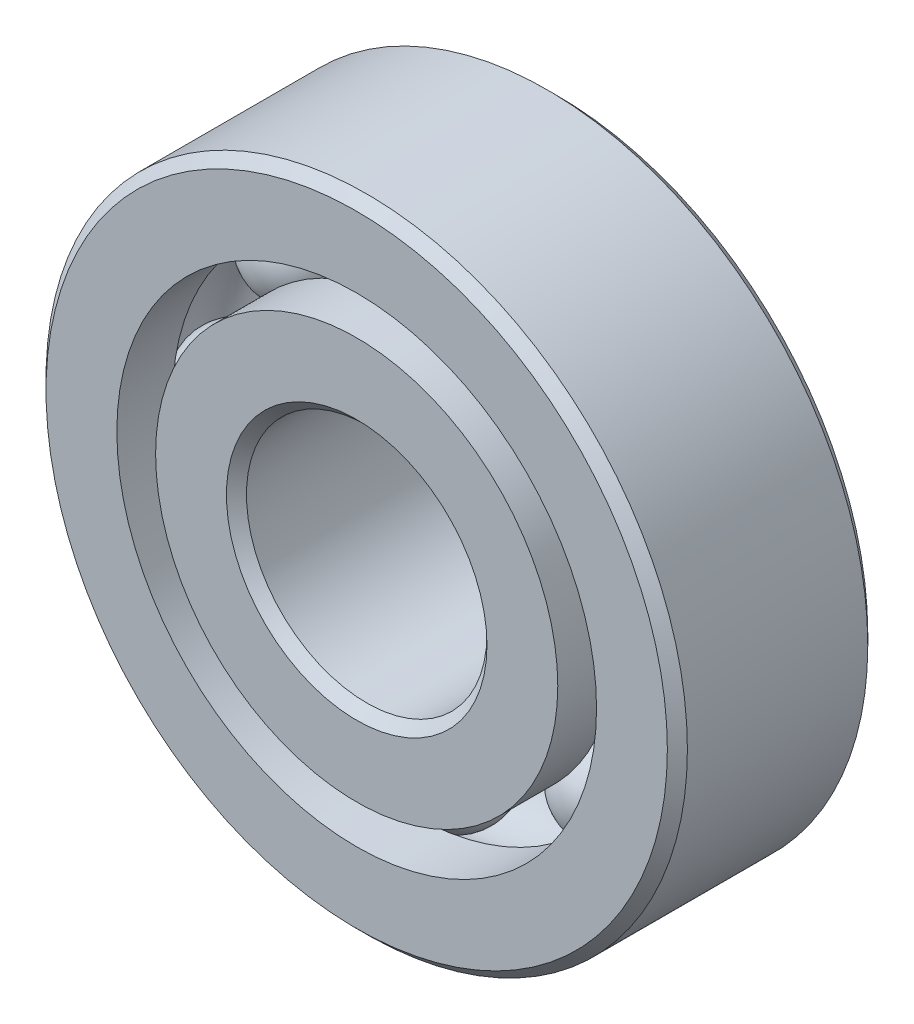
ISO-10303-21;
HEADER;
FILE_DESCRIPTION(('STEP AP214'),'2;1');
FILE_NAME('part.step','',(''),(''),'','','');
FILE_SCHEMA(('AUTOMOTIVE_DESIGN { 1 0 10303 214 1 1 1 1 }'));
ENDSEC;
DATA;
#1=APPLICATION_CONTEXT('core data for automotive mechanical design processes');
#2=APPLICATION_PROTOCOL_DEFINITION('international standard','automotive_design',2000,#1);
#3=PRODUCT_CONTEXT('',#1,'mechanical');
#4=PRODUCT('Part','Part','',(#3));
#5=PRODUCT_RELATED_PRODUCT_CATEGORY('part','',(#4));
#6=PRODUCT_DEFINITION_FORMATION('','',#4);
#7=PRODUCT_DEFINITION_CONTEXT('part definition',#1,'design');
#8=PRODUCT_DEFINITION('design','',#6,#7);
#9=PRODUCT_DEFINITION_SHAPE('','',#8);
#10=(LENGTH_UNIT() NAMED_UNIT(*) SI_UNIT(.MILLI.,.METRE.));
#11=(NAMED_UNIT(*) PLANE_ANGLE_UNIT() SI_UNIT($,.RADIAN.));
#12=(NAMED_UNIT(*) SI_UNIT($,.STERADIAN.) SOLID_ANGLE_UNIT());
#13=UNCERTAINTY_MEASURE_WITH_UNIT(LENGTH_MEASURE(1.E-05),#10,'distance_accuracy_value','');
#14=(GEOMETRIC_REPRESENTATION_CONTEXT(3) GLOBAL_UNCERTAINTY_ASSIGNED_CONTEXT((#13)) GLOBAL_UNIT_ASSIGNED_CONTEXT((#10,
#11,#12)) REPRESENTATION_CONTEXT('',''));
#15=CARTESIAN_POINT('',(0.,0.,0.));
#16=DIRECTION('',(0.,0.,1.));
#17=DIRECTION('',(1.,0.,0.));
#18=AXIS2_PLACEMENT_3D('',#15,#16,#17);
#19=CARTESIAN_POINT('',(-3.08696304161748,3.08696304161756,0.));
#20=DIRECTION('',(0.,0.,1.));
#21=DIRECTION('',(-0.707106781186539,0.707106781186556,0.));
#22=AXIS2_PLACEMENT_3D('',#19,#20,#21);
#23=SPHERICAL_SURFACE('',#22,0.961832467237323);
#24=CARTESIAN_POINT('',(-3.08696304161748,3.08696304161756,0.96183246723732));
#25=VERTEX_POINT('',#24);
#26=VERTEX_LOOP('',#25);
#27=FACE_BOUND('',#26,.T.);
#28=ADVANCED_FACE('F37',(#27),#23,.T.);
#29=CLOSED_SHELL('',(#28));
#30=MANIFOLD_SOLID_BREP('B2',#29);
#31=CARTESIAN_POINT('',(-4.365625,0.,0.));
#32=DIRECTION('',(0.,0.,1.));
#33=DIRECTION('',(-1.,0.,0.));
#34=AXIS2_PLACEMENT_3D('',#31,#32,#33);
#35=SPHERICAL_SURFACE('',#34,0.961832467237323);
#36=CARTESIAN_POINT('',(-4.365625,0.,0.96183246723732));
#37=VERTEX_POINT('',#36);
#38=VERTEX_LOOP('',#37);
#39=FACE_BOUND('',#38,.T.);
#40=ADVANCED_FACE('F57',(#39),#35,.T.);
#41=CLOSED_SHELL('',(#40));
#42=MANIFOLD_SOLID_BREP('B6',#41);
#43=CARTESIAN_POINT('',(-3.08696304161755,-3.08696304161749,0.));
#44=DIRECTION('',(0.,0.,1.));
#45=DIRECTION('',(-0.707106781186554,-0.707106781186541,0.));
#46=AXIS2_PLACEMENT_3D('',#43,#44,#45);
#47=SPHERICAL_SURFACE('',#46,0.961832467237323);
#48=CARTESIAN_POINT('',(-3.08696304161755,-3.08696304161749,0.96183246723732));
#49=VERTEX_POINT('',#48);
#50=VERTEX_LOOP('',#49);
#51=FACE_BOUND('',#50,.T.);
#52=ADVANCED_FACE('F77',(#51),#47,.T.);
#53=CLOSED_SHELL('',(#52));
#54=MANIFOLD_SOLID_BREP('B33',#53);
#55=CARTESIAN_POINT('',(0.,-4.365625,0.));
#56=DIRECTION('',(0.,0.,1.));
#57=DIRECTION('',(0.,-1.,0.));
#58=AXIS2_PLACEMENT_3D('',#55,#56,#57);
#59=SPHERICAL_SURFACE('',#58,0.961832467237323);
#60=CARTESIAN_POINT('',(0.,-4.365625,0.96183246723732));
#61=VERTEX_POINT('',#60);
#62=VERTEX_LOOP('',#61);
#63=FACE_BOUND('',#62,.T.);
#64=ADVANCED_FACE('F97',(#63),#59,.T.);
#65=CLOSED_SHELL('',(#64));
#66=MANIFOLD_SOLID_BREP('B53',#65);
#67=CARTESIAN_POINT('',(3.0869630416175,-3.08696304161754,0.));
#68=DIRECTION('',(0.,0.,1.));
#69=DIRECTION('',(0.707106781186544,-0.707106781186551,0.));
#70=AXIS2_PLACEMENT_3D('',#67,#68,#69);
#71=SPHERICAL_SURFACE('',#70,0.961832467237323);
#72=CARTESIAN_POINT('',(3.0869630416175,-3.08696304161754,0.96183246723732));
#73=VERTEX_POINT('',#72);
#74=VERTEX_LOOP('',#73);
#75=FACE_BOUND('',#74,.T.);
#76=ADVANCED_FACE('F117',(#75),#71,.T.);
#77=CLOSED_SHELL('',(#76));
#78=MANIFOLD_SOLID_BREP('B73',#77);
#79=CARTESIAN_POINT('',(4.365625,0.,0.));
#80=DIRECTION('',(0.,0.,1.));
#81=DIRECTION('',(1.,0.,0.));
#82=AXIS2_PLACEMENT_3D('',#79,#80,#81);
#83=SPHERICAL_SURFACE('',#82,0.961832467237323);
#84=CARTESIAN_POINT('',(4.365625,0.,0.96183246723732));
#85=VERTEX_POINT('',#84);
#86=VERTEX_LOOP('',#85);
#87=FACE_BOUND('',#86,.T.);
#88=ADVANCED_FACE('F137',(#87),#83,.T.);
#89=CLOSED_SHELL('',(#88));
#90=MANIFOLD_SOLID_BREP('B93',#89);
#91=CARTESIAN_POINT('',(3.08696304161753,3.08696304161751,0.));
#92=DIRECTION('',(0.,0.,1.));
#93=DIRECTION('',(0.707106781186549,0.707106781186546,0.));
#94=AXIS2_PLACEMENT_3D('',#91,#92,#93);
#95=SPHERICAL_SURFACE('',#94,0.961832467237323);
#96=CARTESIAN_POINT('',(3.08696304161753,3.08696304161751,0.96183246723732));
#97=VERTEX_POINT('',#96);
#98=VERTEX_LOOP('',#97);
#99=FACE_BOUND('',#98,.T.);
#100=ADVANCED_FACE('F157',(#99),#95,.T.);
#101=CLOSED_SHELL('',(#100));
#102=MANIFOLD_SOLID_BREP('B113',#101);
#103=CARTESIAN_POINT('',(0.,4.365625,0.));
#104=DIRECTION('',(0.,0.,1.));
#105=DIRECTION('',(0.,1.,0.));
#106=AXIS2_PLACEMENT_3D('',#103,#104,#105);
#107=SPHERICAL_SURFACE('',#106,0.961832467237323);
#108=CARTESIAN_POINT('',(0.,4.365625,0.96183246723732));
#109=VERTEX_POINT('',#108);
#110=VERTEX_LOOP('',#109);
#111=FACE_BOUND('',#110,.T.);
#112=ADVANCED_FACE('F179',(#111),#107,.T.);
#113=CLOSED_SHELL('',(#112));
#114=MANIFOLD_SOLID_BREP('B133',#113);
#115=CARTESIAN_POINT('',(0.,3.98183379120879,1.984375));
#116=DIRECTION('',(0.,0.,-1.));
#117=DIRECTION('',(-1.,0.,0.));
#118=AXIS2_PLACEMENT_3D('',#115,#116,#117);
#119=PLANE('',#118);
#120=CARTESIAN_POINT('',(0.,0.,1.984375));
#121=DIRECTION('',(0.,0.,1.));
#122=DIRECTION('',(1.,0.,0.));
#123=AXIS2_PLACEMENT_3D('',#120,#121,#122);
#124=CIRCLE('',#123,2.5796875);
#125=CARTESIAN_POINT('',(2.5796875,0.,1.984375));
#126=VERTEX_POINT('',#125);
#127=EDGE_CURVE('E226',#126,#126,#124,.T.);
#128=ORIENTED_EDGE('',*,*,#127,.F.);
#129=EDGE_LOOP('',(#128));
#130=FACE_BOUND('',#129,.T.);
#131=CARTESIAN_POINT('',(0.,0.,1.984375));
#132=DIRECTION('',(0.,0.,1.));
#133=DIRECTION('',(1.,0.,0.));
#134=AXIS2_PLACEMENT_3D('',#131,#132,#133);
#135=CIRCLE('',#134,3.98183379120879);
#136=CARTESIAN_POINT('',(3.98183379120879,0.,1.984375));
#137=VERTEX_POINT('',#136);
#138=EDGE_CURVE('E178',#137,#137,#135,.T.);
#139=ORIENTED_EDGE('',*,*,#138,.T.);
#140=EDGE_LOOP('',(#139));
#141=FACE_BOUND('',#140,.T.);
#142=ADVANCED_FACE('F198',(#130,#141),#119,.F.);
#143=CARTESIAN_POINT('',(0.,0.,1.984375));
#144=DIRECTION('',(0.,0.,1.));
#145=DIRECTION('',(1.,0.,0.));
#146=AXIS2_PLACEMENT_3D('',#143,#144,#145);
#147=CYLINDRICAL_SURFACE('',#146,3.98183379120879);
#148=ORIENTED_EDGE('',*,*,#138,.F.);
#149=EDGE_LOOP('',(#148));
#150=FACE_BOUND('',#149,.T.);
#151=CARTESIAN_POINT('',(0.,0.,0.881944444444442));
#152=DIRECTION('',(0.,0.,1.));
#153=DIRECTION('',(1.,0.,0.));
#154=AXIS2_PLACEMENT_3D('',#151,#152,#153);
#155=CIRCLE('',#154,3.98183379120879);
#156=CARTESIAN_POINT('',(3.98183379120879,0.,0.881944444444442));
#157=VERTEX_POINT('',#156);
#158=EDGE_CURVE('E204',#157,#157,#155,.T.);
#159=ORIENTED_EDGE('',*,*,#158,.T.);
#160=EDGE_LOOP('',(#159));
#161=FACE_BOUND('',#160,.T.);
#162=ADVANCED_FACE('F233',(#150,#161),#147,.T.);
#163=CARTESIAN_POINT('',(0.,0.,0.));
#164=DIRECTION('',(0.,0.,1.));
#165=DIRECTION('',(1.,0.,0.));
#166=AXIS2_PLACEMENT_3D('',#163,#164,#165);
#167=TOROIDAL_SURFACE('',#166,4.365625,0.961832467237319);
#168=ORIENTED_EDGE('',*,*,#158,.F.);
#169=EDGE_LOOP('',(#168));
#170=FACE_BOUND('',#169,.T.);
#171=CARTESIAN_POINT('',(0.,0.,-0.881944444444445));
#172=DIRECTION('',(0.,0.,1.));
#173=DIRECTION('',(1.,0.,0.));
#174=AXIS2_PLACEMENT_3D('',#171,#172,#173);
#175=CIRCLE('',#174,3.98183379120879);
#176=CARTESIAN_POINT('',(3.98183379120879,0.,-0.881944444444445));
#177=VERTEX_POINT('',#176);
#178=EDGE_CURVE('E208',#177,#177,#175,.T.);
#179=ORIENTED_EDGE('',*,*,#178,.T.);
#180=EDGE_LOOP('',(#179));
#181=FACE_BOUND('',#180,.T.);
#182=ADVANCED_FACE('F237',(#170,#181),#167,.F.);
#183=CARTESIAN_POINT('',(0.,0.,1.984375));
#184=DIRECTION('',(0.,0.,1.));
#185=DIRECTION('',(1.,0.,0.));
#186=AXIS2_PLACEMENT_3D('',#183,#184,#185);
#187=CYLINDRICAL_SURFACE('',#186,3.98183379120879);
#188=ORIENTED_EDGE('',*,*,#178,.F.);
#189=EDGE_LOOP('',(#188));
#190=FACE_BOUND('',#189,.T.);
#191=CARTESIAN_POINT('',(0.,0.,-1.984375));
#192=DIRECTION('',(0.,0.,1.));
#193=DIRECTION('',(1.,0.,0.));
#194=AXIS2_PLACEMENT_3D('',#191,#192,#193);
#195=CIRCLE('',#194,3.98183379120879);
#196=CARTESIAN_POINT('',(3.98183379120879,0.,-1.984375));
#197=VERTEX_POINT('',#196);
#198=EDGE_CURVE('E212',#197,#197,#195,.T.);
#199=ORIENTED_EDGE('',*,*,#198,.T.);
#200=EDGE_LOOP('',(#199));
#201=FACE_BOUND('',#200,.T.);
#202=ADVANCED_FACE('F242',(#190,#201),#187,.T.);
#203=CARTESIAN_POINT('',(0.,2.5796875,-1.98437500000001));
#204=DIRECTION('',(0.,0.,1.));
#205=DIRECTION('',(1.,0.,0.));
#206=AXIS2_PLACEMENT_3D('',#203,#204,#205);
#207=PLANE('',#206);
#208=ORIENTED_EDGE('',*,*,#198,.F.);
#209=EDGE_LOOP('',(#208));
#210=FACE_BOUND('',#209,.T.);
#211=CARTESIAN_POINT('',(0.,0.,-1.98437500000001));
#212=DIRECTION('',(0.,0.,1.));
#213=DIRECTION('',(1.,0.,0.));
#214=AXIS2_PLACEMENT_3D('',#211,#212,#213);
#215=CIRCLE('',#214,2.5796875);
#216=CARTESIAN_POINT('',(2.5796875,0.,-1.98437500000001));
#217=VERTEX_POINT('',#216);
#218=EDGE_CURVE('E217',#217,#217,#215,.T.);
#219=ORIENTED_EDGE('',*,*,#218,.T.);
#220=EDGE_LOOP('',(#219));
#221=FACE_BOUND('',#220,.T.);
#222=ADVANCED_FACE('F248',(#210,#221),#207,.F.);
#223=CARTESIAN_POINT('',(0.,0.,-1.78593750000001));
#224=DIRECTION('',(0.,0.,-1.));
#225=DIRECTION('',(-1.,0.,0.));
#226=AXIS2_PLACEMENT_3D('',#223,#224,#225);
#227=CONICAL_SURFACE('',#226,2.38125,0.785398163397456);
#228=ORIENTED_EDGE('',*,*,#218,.F.);
#229=EDGE_LOOP('',(#228));
#230=FACE_BOUND('',#229,.T.);
#231=CARTESIAN_POINT('',(0.,0.,-1.78593750000001));
#232=DIRECTION('',(0.,0.,1.));
#233=DIRECTION('',(1.,0.,0.));
#234=AXIS2_PLACEMENT_3D('',#231,#232,#233);
#235=CIRCLE('',#234,2.38125);
#236=CARTESIAN_POINT('',(2.38125,0.,-1.78593750000001));
#237=VERTEX_POINT('',#236);
#238=EDGE_CURVE('E220',#237,#237,#235,.T.);
#239=ORIENTED_EDGE('',*,*,#238,.T.);
#240=EDGE_LOOP('',(#239));
#241=FACE_BOUND('',#240,.T.);
#242=ADVANCED_FACE('F252',(#230,#241),#227,.F.);
#243=CARTESIAN_POINT('',(0.,0.,1.984375));
#244=DIRECTION('',(0.,0.,1.));
#245=DIRECTION('',(1.,0.,0.));
#246=AXIS2_PLACEMENT_3D('',#243,#244,#245);
#247=CYLINDRICAL_SURFACE('',#246,2.38125);
#248=ORIENTED_EDGE('',*,*,#238,.F.);
#249=EDGE_LOOP('',(#248));
#250=FACE_BOUND('',#249,.T.);
#251=CARTESIAN_POINT('',(0.,0.,1.7859375));
#252=DIRECTION('',(0.,0.,1.));
#253=DIRECTION('',(1.,0.,0.));
#254=AXIS2_PLACEMENT_3D('',#251,#252,#253);
#255=CIRCLE('',#254,2.38125);
#256=CARTESIAN_POINT('',(2.38125,0.,1.7859375));
#257=VERTEX_POINT('',#256);
#258=EDGE_CURVE('E223',#257,#257,#255,.T.);
#259=ORIENTED_EDGE('',*,*,#258,.T.);
#260=EDGE_LOOP('',(#259));
#261=FACE_BOUND('',#260,.T.);
#262=ADVANCED_FACE('F256',(#250,#261),#247,.F.);
#263=CARTESIAN_POINT('',(0.,0.,1.984375));
#264=DIRECTION('',(0.,0.,1.));
#265=DIRECTION('',(1.,0.,0.));
#266=AXIS2_PLACEMENT_3D('',#263,#264,#265);
#267=CONICAL_SURFACE('',#266,2.5796875,0.785398163397444);
#268=ORIENTED_EDGE('',*,*,#258,.F.);
#269=EDGE_LOOP('',(#268));
#270=FACE_BOUND('',#269,.T.);
#271=ORIENTED_EDGE('',*,*,#127,.T.);
#272=EDGE_LOOP('',(#271));
#273=FACE_BOUND('',#272,.T.);
#274=ADVANCED_FACE('F230',(#270,#273),#267,.F.);
#275=CLOSED_SHELL('',(#142,#162,#182,#202,#222,#242,#262,#274));
#276=MANIFOLD_SOLID_BREP('B153',#275);
#277=CARTESIAN_POINT('',(0.,0.,1.7859375));
#278=DIRECTION('',(0.,0.,-1.));
#279=DIRECTION('',(-1.,0.,0.));
#280=AXIS2_PLACEMENT_3D('',#277,#278,#279);
#281=CONICAL_SURFACE('',#280,6.35,0.785398163397446);
#282=CARTESIAN_POINT('',(0.,0.,1.984375));
#283=DIRECTION('',(0.,0.,1.));
#284=DIRECTION('',(1.,0.,0.));
#285=AXIS2_PLACEMENT_3D('',#282,#283,#284);
#286=CIRCLE('',#285,6.1515625);
#287=CARTESIAN_POINT('',(6.1515625,0.,1.984375));
#288=VERTEX_POINT('',#287);
#289=EDGE_CURVE('E347',#288,#288,#286,.T.);
#290=ORIENTED_EDGE('',*,*,#289,.F.);
#291=EDGE_LOOP('',(#290));
#292=FACE_BOUND('',#291,.T.);
#293=CARTESIAN_POINT('',(0.,0.,1.7859375));
#294=DIRECTION('',(0.,0.,1.));
#295=DIRECTION('',(1.,0.,0.));
#296=AXIS2_PLACEMENT_3D('',#293,#294,#295);
#297=CIRCLE('',#296,6.35);
#298=CARTESIAN_POINT('',(6.35,0.,1.7859375));
#299=VERTEX_POINT('',#298);
#300=EDGE_CURVE('E197',#299,#299,#297,.T.);
#301=ORIENTED_EDGE('',*,*,#300,.T.);
#302=EDGE_LOOP('',(#301));
#303=FACE_BOUND('',#302,.T.);
#304=ADVANCED_FACE('F319',(#292,#303),#281,.T.);
#305=CARTESIAN_POINT('',(0.,0.,1.984375));
#306=DIRECTION('',(0.,0.,1.));
#307=DIRECTION('',(1.,0.,0.));
#308=AXIS2_PLACEMENT_3D('',#305,#306,#307);
#309=CYLINDRICAL_SURFACE('',#308,6.35);
#310=ORIENTED_EDGE('',*,*,#300,.F.);
#311=EDGE_LOOP('',(#310));
#312=FACE_BOUND('',#311,.T.);
#313=CARTESIAN_POINT('',(0.,0.,-1.78593750000001));
#314=DIRECTION('',(0.,0.,1.));
#315=DIRECTION('',(1.,0.,0.));
#316=AXIS2_PLACEMENT_3D('',#313,#314,#315);
#317=CIRCLE('',#316,6.35);
#318=CARTESIAN_POINT('',(6.35,0.,-1.78593750000001));
#319=VERTEX_POINT('',#318);
#320=EDGE_CURVE('E325',#319,#319,#317,.T.);
#321=ORIENTED_EDGE('',*,*,#320,.T.);
#322=EDGE_LOOP('',(#321));
#323=FACE_BOUND('',#322,.T.);
#324=ADVANCED_FACE('F354',(#312,#323),#309,.T.);
#325=CARTESIAN_POINT('',(0.,0.,-1.98437500000001));
#326=DIRECTION('',(0.,0.,1.));
#327=DIRECTION('',(1.,0.,0.));
#328=AXIS2_PLACEMENT_3D('',#325,#326,#327);
#329=CONICAL_SURFACE('',#328,6.1515625,0.785398163397447);
#330=ORIENTED_EDGE('',*,*,#320,.F.);
#331=EDGE_LOOP('',(#330));
#332=FACE_BOUND('',#331,.T.);
#333=CARTESIAN_POINT('',(0.,0.,-1.98437500000001));
#334=DIRECTION('',(0.,0.,1.));
#335=DIRECTION('',(1.,0.,0.));
#336=AXIS2_PLACEMENT_3D('',#333,#334,#335);
#337=CIRCLE('',#336,6.1515625);
#338=CARTESIAN_POINT('',(6.1515625,0.,-1.98437500000001));
#339=VERTEX_POINT('',#338);
#340=EDGE_CURVE('E329',#339,#339,#337,.T.);
#341=ORIENTED_EDGE('',*,*,#340,.T.);
#342=EDGE_LOOP('',(#341));
#343=FACE_BOUND('',#342,.T.);
#344=ADVANCED_FACE('F358',(#332,#343),#329,.T.);
#345=CARTESIAN_POINT('',(0.,6.1515625,-1.98437500000001));
#346=DIRECTION('',(0.,0.,1.));
#347=DIRECTION('',(1.,0.,0.));
#348=AXIS2_PLACEMENT_3D('',#345,#346,#347);
#349=PLANE('',#348);
#350=ORIENTED_EDGE('',*,*,#340,.F.);
#351=EDGE_LOOP('',(#350));
#352=FACE_BOUND('',#351,.T.);
#353=CARTESIAN_POINT('',(0.,0.,-1.98437500000001));
#354=DIRECTION('',(0.,0.,1.));
#355=DIRECTION('',(1.,0.,0.));
#356=AXIS2_PLACEMENT_3D('',#353,#354,#355);
#357=CIRCLE('',#356,4.74941620879121);
#358=CARTESIAN_POINT('',(4.74941620879121,0.,-1.98437500000001));
#359=VERTEX_POINT('',#358);
#360=EDGE_CURVE('E333',#359,#359,#357,.T.);
#361=ORIENTED_EDGE('',*,*,#360,.T.);
#362=EDGE_LOOP('',(#361));
#363=FACE_BOUND('',#362,.T.);
#364=ADVANCED_FACE('F363',(#352,#363),#349,.F.);
#365=CARTESIAN_POINT('',(0.,0.,1.984375));
#366=DIRECTION('',(0.,0.,1.));
#367=DIRECTION('',(1.,0.,0.));
#368=AXIS2_PLACEMENT_3D('',#365,#366,#367);
#369=CYLINDRICAL_SURFACE('',#368,4.74941620879121);
#370=ORIENTED_EDGE('',*,*,#360,.F.);
#371=EDGE_LOOP('',(#370));
#372=FACE_BOUND('',#371,.T.);
#373=CARTESIAN_POINT('',(0.,0.,-0.881944444444447));
#374=DIRECTION('',(0.,0.,1.));
#375=DIRECTION('',(1.,0.,0.));
#376=AXIS2_PLACEMENT_3D('',#373,#374,#375);
#377=CIRCLE('',#376,4.74941620879121);
#378=CARTESIAN_POINT('',(4.74941620879121,0.,-0.881944444444447));
#379=VERTEX_POINT('',#378);
#380=EDGE_CURVE('E338',#379,#379,#377,.T.);
#381=ORIENTED_EDGE('',*,*,#380,.T.);
#382=EDGE_LOOP('',(#381));
#383=FACE_BOUND('',#382,.T.);
#384=ADVANCED_FACE('F369',(#372,#383),#369,.F.);
#385=CARTESIAN_POINT('',(0.,0.,0.));
#386=DIRECTION('',(0.,0.,1.));
#387=DIRECTION('',(1.,0.,0.));
#388=AXIS2_PLACEMENT_3D('',#385,#386,#387);
#389=TOROIDAL_SURFACE('',#388,4.365625,0.961832467237323);
#390=ORIENTED_EDGE('',*,*,#380,.F.);
#391=EDGE_LOOP('',(#390));
#392=FACE_BOUND('',#391,.T.);
#393=CARTESIAN_POINT('',(0.,0.,0.881944444444441));
#394=DIRECTION('',(0.,0.,1.));
#395=DIRECTION('',(1.,0.,0.));
#396=AXIS2_PLACEMENT_3D('',#393,#394,#395);
#397=CIRCLE('',#396,4.74941620879121);
#398=CARTESIAN_POINT('',(4.74941620879121,0.,0.881944444444441));
#399=VERTEX_POINT('',#398);
#400=EDGE_CURVE('E341',#399,#399,#397,.T.);
#401=ORIENTED_EDGE('',*,*,#400,.T.);
#402=EDGE_LOOP('',(#401));
#403=FACE_BOUND('',#402,.T.);
#404=ADVANCED_FACE('F373',(#392,#403),#389,.F.);
#405=CARTESIAN_POINT('',(0.,0.,1.984375));
#406=DIRECTION('',(0.,0.,1.));
#407=DIRECTION('',(1.,0.,0.));
#408=AXIS2_PLACEMENT_3D('',#405,#406,#407);
#409=CYLINDRICAL_SURFACE('',#408,4.74941620879121);
#410=ORIENTED_EDGE('',*,*,#400,.F.);
#411=EDGE_LOOP('',(#410));
#412=FACE_BOUND('',#411,.T.);
#413=CARTESIAN_POINT('',(0.,0.,1.984375));
#414=DIRECTION('',(0.,0.,1.));
#415=DIRECTION('',(1.,0.,0.));
#416=AXIS2_PLACEMENT_3D('',#413,#414,#415);
#417=CIRCLE('',#416,4.74941620879121);
#418=CARTESIAN_POINT('',(4.74941620879121,0.,1.984375));
#419=VERTEX_POINT('',#418);
#420=EDGE_CURVE('E344',#419,#419,#417,.T.);
#421=ORIENTED_EDGE('',*,*,#420,.T.);
#422=EDGE_LOOP('',(#421));
#423=FACE_BOUND('',#422,.T.);
#424=ADVANCED_FACE('F377',(#412,#423),#409,.F.);
#425=CARTESIAN_POINT('',(0.,6.1515625,1.984375));
#426=DIRECTION('',(0.,0.,-1.));
#427=DIRECTION('',(-1.,0.,0.));
#428=AXIS2_PLACEMENT_3D('',#425,#426,#427);
#429=PLANE('',#428);
#430=ORIENTED_EDGE('',*,*,#420,.F.);
#431=EDGE_LOOP('',(#430));
#432=FACE_BOUND('',#431,.T.);
#433=ORIENTED_EDGE('',*,*,#289,.T.);
#434=EDGE_LOOP('',(#433));
#435=FACE_BOUND('',#434,.T.);
#436=ADVANCED_FACE('F351',(#432,#435),#429,.F.);
#437=CLOSED_SHELL('',(#304,#324,#344,#364,#384,#404,#424,#436));
#438=MANIFOLD_SOLID_BREP('B173',#437);
#439=ADVANCED_BREP_SHAPE_REPRESENTATION('',(#18,#30,#42,#54,#66,#78,#90,#102,#114,#276,#438),#14);
#440=SHAPE_DEFINITION_REPRESENTATION(#9,#439);
ENDSEC;
END-ISO-10303-21;
